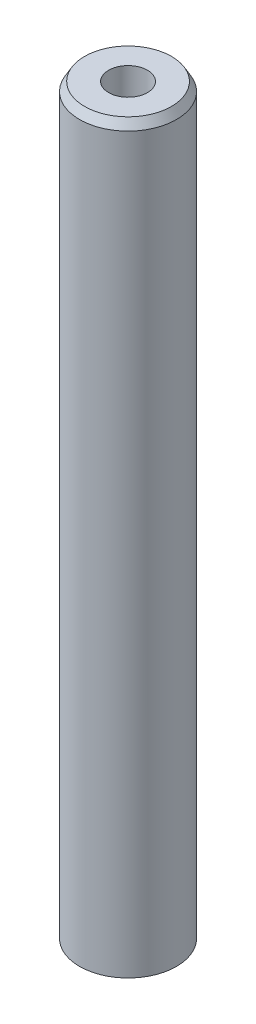
ISO-10303-21;
HEADER;
FILE_DESCRIPTION(('STEP AP214'),'2;1');
FILE_NAME('part.step','',(''),(''),'','','');
FILE_SCHEMA(('AUTOMOTIVE_DESIGN { 1 0 10303 214 1 1 1 1 }'));
ENDSEC;
DATA;
#1=APPLICATION_CONTEXT('core data for automotive mechanical design processes');
#2=APPLICATION_PROTOCOL_DEFINITION('international standard','automotive_design',2000,#1);
#3=PRODUCT_CONTEXT('',#1,'mechanical');
#4=PRODUCT('Part','Part','',(#3));
#5=PRODUCT_RELATED_PRODUCT_CATEGORY('part','',(#4));
#6=PRODUCT_DEFINITION_FORMATION('','',#4);
#7=PRODUCT_DEFINITION_CONTEXT('part definition',#1,'design');
#8=PRODUCT_DEFINITION('design','',#6,#7);
#9=PRODUCT_DEFINITION_SHAPE('','',#8);
#10=(LENGTH_UNIT() NAMED_UNIT(*) SI_UNIT(.MILLI.,.METRE.));
#11=(NAMED_UNIT(*) PLANE_ANGLE_UNIT() SI_UNIT($,.RADIAN.));
#12=(NAMED_UNIT(*) SI_UNIT($,.STERADIAN.) SOLID_ANGLE_UNIT());
#13=UNCERTAINTY_MEASURE_WITH_UNIT(LENGTH_MEASURE(1.E-05),#10,'distance_accuracy_value','');
#14=(GEOMETRIC_REPRESENTATION_CONTEXT(3) GLOBAL_UNCERTAINTY_ASSIGNED_CONTEXT((#13)) GLOBAL_UNIT_ASSIGNED_CONTEXT((#10,
#11,#12)) REPRESENTATION_CONTEXT('',''));
#15=CARTESIAN_POINT('',(0.,0.,0.));
#16=DIRECTION('',(0.,0.,1.));
#17=DIRECTION('',(1.,0.,0.));
#18=AXIS2_PLACEMENT_3D('',#15,#16,#17);
#19=CARTESIAN_POINT('',(0.,77.0648361165474,0.));
#20=DIRECTION('',(0.,-1.,0.));
#21=DIRECTION('',(0.,0.,-1.));
#22=AXIS2_PLACEMENT_3D('',#19,#20,#21);
#23=CYLINDRICAL_SURFACE('',#22,5.);
#24=CARTESIAN_POINT('',(0.,76.1591965401109,0.));
#25=DIRECTION('',(0.,1.,0.));
#26=DIRECTION('',(0.,0.,1.));
#27=AXIS2_PLACEMENT_3D('',#24,#25,#26);
#28=CIRCLE('',#27,5.);
#29=CARTESIAN_POINT('',(0.,76.1591965401109,-5.));
#30=VERTEX_POINT('',#29);
#31=EDGE_CURVE('E50',#30,#30,#28,.F.);
#32=ORIENTED_EDGE('',*,*,#31,.T.);
#33=EDGE_LOOP('',(#32));
#34=FACE_BOUND('',#33,.T.);
#35=CARTESIAN_POINT('',(0.,0.52287125324442,0.));
#36=DIRECTION('',(0.,1.,0.));
#37=DIRECTION('',(0.,0.,1.));
#38=AXIS2_PLACEMENT_3D('',#35,#36,#37);
#39=CIRCLE('',#38,5.);
#40=CARTESIAN_POINT('',(0.,0.52287125324442,5.));
#41=VERTEX_POINT('',#40);
#42=EDGE_CURVE('E51',#41,#41,#39,.T.);
#43=ORIENTED_EDGE('',*,*,#42,.T.);
#44=EDGE_LOOP('',(#43));
#45=FACE_BOUND('',#44,.T.);
#46=ADVANCED_FACE('F39',(#34,#45),#23,.T.);
#47=CARTESIAN_POINT('',(0.,77.0648361165474,0.));
#48=DIRECTION('',(0.,1.,0.));
#49=DIRECTION('',(0.,0.,1.));
#50=AXIS2_PLACEMENT_3D('',#47,#48,#49);
#51=PLANE('',#50);
#52=CARTESIAN_POINT('',(0.,77.0648361165474,0.));
#53=DIRECTION('',(0.,1.,0.));
#54=DIRECTION('',(0.,0.,1.));
#55=AXIS2_PLACEMENT_3D('',#52,#53,#54);
#56=CIRCLE('',#55,4.47712874675559);
#57=CARTESIAN_POINT('',(0.,77.0648361165474,-4.4771287467556));
#58=VERTEX_POINT('',#57);
#59=EDGE_CURVE('E54',#58,#58,#56,.T.);
#60=ORIENTED_EDGE('',*,*,#59,.T.);
#61=EDGE_LOOP('',(#60));
#62=FACE_BOUND('',#61,.T.);
#63=CARTESIAN_POINT('',(0.,77.0648361165474,0.));
#64=DIRECTION('',(0.,1.,0.));
#65=DIRECTION('',(0.,0.,1.));
#66=AXIS2_PLACEMENT_3D('',#63,#64,#65);
#67=CIRCLE('',#66,2.00325688577948);
#68=CARTESIAN_POINT('',(0.,77.0648361165474,2.00325688577948));
#69=VERTEX_POINT('',#68);
#70=EDGE_CURVE('E58',#69,#69,#67,.T.);
#71=ORIENTED_EDGE('',*,*,#70,.F.);
#72=EDGE_LOOP('',(#71));
#73=FACE_BOUND('',#72,.T.);
#74=ADVANCED_FACE('F69',(#62,#73),#51,.T.);
#75=CARTESIAN_POINT('',(0.,0.,0.));
#76=DIRECTION('',(0.,1.,0.));
#77=DIRECTION('',(0.,0.,1.));
#78=AXIS2_PLACEMENT_3D('',#75,#76,#77);
#79=PLANE('',#78);
#80=CARTESIAN_POINT('',(0.,0.,0.));
#81=DIRECTION('',(0.,1.,0.));
#82=DIRECTION('',(0.,0.,1.));
#83=AXIS2_PLACEMENT_3D('',#80,#81,#82);
#84=CIRCLE('',#83,4.09436042356345);
#85=CARTESIAN_POINT('',(0.,0.,4.09436042356345));
#86=VERTEX_POINT('',#85);
#87=EDGE_CURVE('E10',#86,#86,#84,.F.);
#88=ORIENTED_EDGE('',*,*,#87,.T.);
#89=EDGE_LOOP('',(#88));
#90=FACE_BOUND('',#89,.T.);
#91=CARTESIAN_POINT('',(0.,0.,0.));
#92=DIRECTION('',(0.,1.,0.));
#93=DIRECTION('',(0.,0.,1.));
#94=AXIS2_PLACEMENT_3D('',#91,#92,#93);
#95=CIRCLE('',#94,2.00325688577948);
#96=CARTESIAN_POINT('',(0.,0.,2.00325688577948));
#97=VERTEX_POINT('',#96);
#98=EDGE_CURVE('E63',#97,#97,#95,.T.);
#99=ORIENTED_EDGE('',*,*,#98,.T.);
#100=EDGE_LOOP('',(#99));
#101=FACE_BOUND('',#100,.T.);
#102=ADVANCED_FACE('F75',(#90,#101),#79,.F.);
#103=CARTESIAN_POINT('',(0.,77.0648361165474,0.));
#104=DIRECTION('',(0.,-1.,0.));
#105=DIRECTION('',(0.,0.,-1.));
#106=AXIS2_PLACEMENT_3D('',#103,#104,#105);
#107=CYLINDRICAL_SURFACE('',#106,2.00325688577948);
#108=ORIENTED_EDGE('',*,*,#70,.T.);
#109=EDGE_LOOP('',(#108));
#110=FACE_BOUND('',#109,.T.);
#111=ORIENTED_EDGE('',*,*,#98,.F.);
#112=EDGE_LOOP('',(#111));
#113=FACE_BOUND('',#112,.T.);
#114=ADVANCED_FACE('F70',(#110,#113),#107,.F.);
#115=CARTESIAN_POINT('',(0.,77.0648361165474,0.));
#116=DIRECTION('',(0.,-1.,0.));
#117=DIRECTION('',(0.,0.,-1.));
#118=AXIS2_PLACEMENT_3D('',#115,#116,#117);
#119=CONICAL_SURFACE('',#118,4.47712874675559,0.523598775598295);
#120=CARTESIAN_POINT('',(0.,76.1591965401109,-5.));
#121=CARTESIAN_POINT('',(0.,76.1686302856988,-4.99455342444537));
#122=CARTESIAN_POINT('',(0.,76.1780640312867,-4.98910684889074));
#123=CARTESIAN_POINT('',(0.,76.1969315224624,-4.97821369778149));
#124=CARTESIAN_POINT('',(0.,76.2063652680503,-4.97276712222686));
#125=CARTESIAN_POINT('',(0.,76.2252327592261,-4.9618739711176));
#126=CARTESIAN_POINT('',(0.,76.2346665048139,-4.95642739556297));
#127=CARTESIAN_POINT('',(0.,76.2535339959897,-4.94553424445371));
#128=CARTESIAN_POINT('',(0.,76.2629677415776,-4.94008766889908));
#129=CARTESIAN_POINT('',(0.,76.2818352327533,-4.92919451778982));
#130=CARTESIAN_POINT('',(0.,76.2912689783412,-4.92374794223519));
#131=CARTESIAN_POINT('',(0.,76.310136469517,-4.91285479112593));
#132=CARTESIAN_POINT('',(0.,76.3195702151049,-4.90740821557131));
#133=CARTESIAN_POINT('',(0.,76.3384377062806,-4.89651506446205));
#134=CARTESIAN_POINT('',(0.,76.3478714518685,-4.89106848890742));
#135=CARTESIAN_POINT('',(0.,76.3667389430443,-4.88017533779816));
#136=CARTESIAN_POINT('',(0.,76.3761726886321,-4.87472876224353));
#137=CARTESIAN_POINT('',(0.,76.3950401798079,-4.86383561113427));
#138=CARTESIAN_POINT('',(0.,76.4044739253958,-4.85838903557964));
#139=CARTESIAN_POINT('',(0.,76.4233414165715,-4.84749588447039));
#140=CARTESIAN_POINT('',(0.,76.4327751621594,-4.84204930891576));
#141=CARTESIAN_POINT('',(0.,76.4516426533352,-4.8311561578065));
#142=CARTESIAN_POINT('',(0.,76.4610763989231,-4.82570958225187));
#143=CARTESIAN_POINT('',(0.,76.4799438900988,-4.81481643114261));
#144=CARTESIAN_POINT('',(0.,76.4893776356867,-4.80936985558798));
#145=CARTESIAN_POINT('',(0.,76.5082451268625,-4.79847670447872));
#146=CARTESIAN_POINT('',(0.,76.5176788724503,-4.79303012892409));
#147=CARTESIAN_POINT('',(0.,76.5365463636261,-4.78213697781483));
#148=CARTESIAN_POINT('',(0.,76.545980109214,-4.7766904022602));
#149=CARTESIAN_POINT('',(0.,76.5648476003898,-4.76579725115095));
#150=CARTESIAN_POINT('',(0.,76.5742813459776,-4.76035067559632));
#151=CARTESIAN_POINT('',(0.,76.5931488371534,-4.74945752448706));
#152=CARTESIAN_POINT('',(0.,76.6025825827413,-4.74401094893243));
#153=CARTESIAN_POINT('',(0.,76.621450073917,-4.73311779782317));
#154=CARTESIAN_POINT('',(0.,76.6308838195049,-4.72767122226854));
#155=CARTESIAN_POINT('',(0.,76.6497513106807,-4.71677807115928));
#156=CARTESIAN_POINT('',(0.,76.6591850562686,-4.71133149560465));
#157=CARTESIAN_POINT('',(0.,76.6780525474443,-4.7004383444954));
#158=CARTESIAN_POINT('',(0.,76.6874862930322,-4.69499176894077));
#159=CARTESIAN_POINT('',(0.,76.706353784208,-4.68409861783151));
#160=CARTESIAN_POINT('',(0.,76.7157875297958,-4.67865204227688));
#161=CARTESIAN_POINT('',(0.,76.7346550209716,-4.66775889116762));
#162=CARTESIAN_POINT('',(0.,76.7440887665595,-4.66231231561299));
#163=CARTESIAN_POINT('',(0.,76.7629562577353,-4.65141916450373));
#164=CARTESIAN_POINT('',(0.,76.7723900033231,-4.64597258894911));
#165=CARTESIAN_POINT('',(0.,76.7912574944989,-4.63507943783985));
#166=CARTESIAN_POINT('',(0.,76.8006912400868,-4.62963286228521));
#167=CARTESIAN_POINT('',(0.,76.8195587312625,-4.61873971117595));
#168=CARTESIAN_POINT('',(0.,76.8289924768504,-4.61329313562133));
#169=CARTESIAN_POINT('',(0.,76.8478599680262,-4.60239998451207));
#170=CARTESIAN_POINT('',(0.,76.8572937136141,-4.59695340895744));
#171=CARTESIAN_POINT('',(0.,76.8761612047898,-4.58606025784818));
#172=CARTESIAN_POINT('',(0.,76.8855949503777,-4.58061368229355));
#173=CARTESIAN_POINT('',(0.,76.9044624415535,-4.56972053118429));
#174=CARTESIAN_POINT('',(0.,76.9138961871413,-4.56427395562966));
#175=CARTESIAN_POINT('',(0.,76.9327636783171,-4.55338080452041));
#176=CARTESIAN_POINT('',(0.,76.942197423905,-4.54793422896577));
#177=CARTESIAN_POINT('',(0.,76.9610649150807,-4.53704107785652));
#178=CARTESIAN_POINT('',(0.,76.9704986606686,-4.53159450230189));
#179=CARTESIAN_POINT('',(0.,76.9893661518444,-4.52070135119263));
#180=CARTESIAN_POINT('',(0.,76.9987998974323,-4.515254775638));
#181=CARTESIAN_POINT('',(0.,77.017667388608,-4.50436162452874));
#182=CARTESIAN_POINT('',(0.,77.0271011341959,-4.49891504897411));
#183=CARTESIAN_POINT('',(0.,77.0459686253717,-4.48802189786485));
#184=CARTESIAN_POINT('',(0.,77.0554023709596,-4.48257532231023));
#185=CARTESIAN_POINT('',(0.,77.0648361165474,-4.4771287467556));
#186=B_SPLINE_CURVE_WITH_KNOTS('',3,(#120,#121,#122,#123,#124,#125,#126,#127,#128,#129,#130,
#131,#132,#133,#134,#135,#136,#137,#138,#139,#140,#141,#142,#143,#144,#145,#146,#147,#148,#149,
#150,#151,#152,#153,#154,#155,#156,#157,#158,#159,#160,#161,#162,#163,#164,#165,#166,#167,#168,
#169,#170,#171,#172,#173,#174,#175,#176,#177,#178,#179,#180,#181,#182,#183,#184,#185),
.UNSPECIFIED.,.F.,.F.,(4,2,2,2,2,2,2,2,2,2,2,2,2,2,2,2,2,2,2,2,2,2,2,2,2,2,2,2,2,2,2,2,4),(0.,
0.0326794533277663,0.0653589066555451,0.0980383599833235,0.130717813311102,0.163397266638868,
0.196076719966646,0.228756173294425,0.261435626622203,0.294115079949981,0.326794533277748,
0.359473986605526,0.392153439933305,0.424832893261083,0.45751234658885,0.490191799916628,
0.522871253244406,0.555550706572185,0.588230159899963,0.620909613227729,0.653589066555508,
0.686268519883286,0.718947973211065,0.751627426538831,0.78430687986661,0.816986333194388,
0.849665786522167,0.882345239849945,0.915024693177711,0.94770414650549,0.980383599833268,
1.01306305316105,1.04574250648883),.UNSPECIFIED.);
#187=EDGE_CURVE('BSEAM81',#30,#58,#186,.T.);
#188=ORIENTED_EDGE('',*,*,#31,.F.);
#189=ORIENTED_EDGE('',*,*,#59,.F.);
#190=ORIENTED_EDGE('',*,*,#187,.T.);
#191=ORIENTED_EDGE('',*,*,#187,.F.);
#192=EDGE_LOOP('',(#188,#190,#189,#191));
#193=FACE_BOUND('',#192,.T.);
#194=ADVANCED_FACE('F81',(#193),#119,.T.);
#195=CARTESIAN_POINT('',(0.,0.52287125324442,0.));
#196=DIRECTION('',(0.,1.,0.));
#197=DIRECTION('',(0.,0.,1.));
#198=AXIS2_PLACEMENT_3D('',#195,#196,#197);
#199=CONICAL_SURFACE('',#198,5.,1.0471975511966);
#200=ORIENTED_EDGE('',*,*,#87,.F.);
#201=EDGE_LOOP('',(#200));
#202=FACE_BOUND('',#201,.T.);
#203=ORIENTED_EDGE('',*,*,#42,.F.);
#204=EDGE_LOOP('',(#203));
#205=FACE_BOUND('',#204,.T.);
#206=ADVANCED_FACE('F45',(#202,#205),#199,.T.);
#207=CLOSED_SHELL('',(#46,#74,#102,#114,#194,#206));
#208=MANIFOLD_SOLID_BREP('B2',#207);
#209=ADVANCED_BREP_SHAPE_REPRESENTATION('',(#18,#208),#14);
#210=SHAPE_DEFINITION_REPRESENTATION(#9,#209);
ENDSEC;
END-ISO-10303-21;
